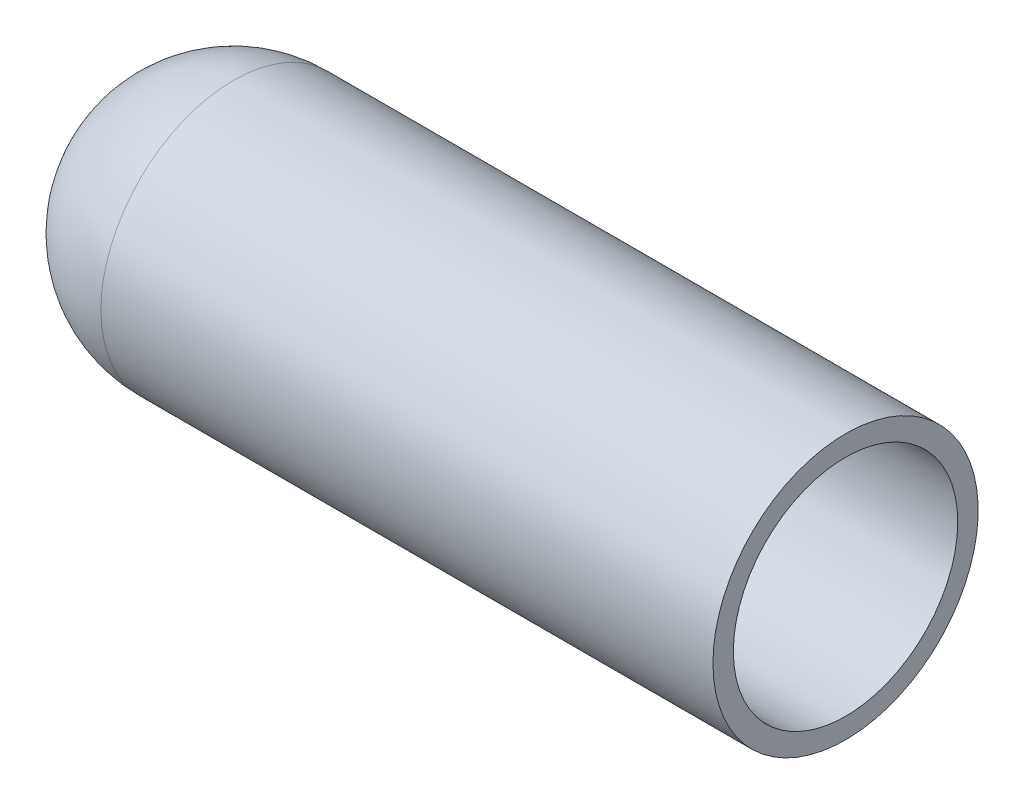
ISO-10303-21;
HEADER;
FILE_DESCRIPTION(('STEP AP214'),'2;1');
FILE_NAME('part.step','',(''),(''),'','','');
FILE_SCHEMA(('AUTOMOTIVE_DESIGN { 1 0 10303 214 1 1 1 1 }'));
ENDSEC;
DATA;
#1=APPLICATION_CONTEXT('core data for automotive mechanical design processes');
#2=APPLICATION_PROTOCOL_DEFINITION('international standard','automotive_design',2000,#1);
#3=PRODUCT_CONTEXT('',#1,'mechanical');
#4=PRODUCT('Part','Part','',(#3));
#5=PRODUCT_RELATED_PRODUCT_CATEGORY('part','',(#4));
#6=PRODUCT_DEFINITION_FORMATION('','',#4);
#7=PRODUCT_DEFINITION_CONTEXT('part definition',#1,'design');
#8=PRODUCT_DEFINITION('design','',#6,#7);
#9=PRODUCT_DEFINITION_SHAPE('','',#8);
#10=(LENGTH_UNIT() NAMED_UNIT(*) SI_UNIT(.MILLI.,.METRE.));
#11=(NAMED_UNIT(*) PLANE_ANGLE_UNIT() SI_UNIT($,.RADIAN.));
#12=(NAMED_UNIT(*) SI_UNIT($,.STERADIAN.) SOLID_ANGLE_UNIT());
#13=UNCERTAINTY_MEASURE_WITH_UNIT(LENGTH_MEASURE(1.E-05),#10,'distance_accuracy_value','');
#14=(GEOMETRIC_REPRESENTATION_CONTEXT(3) GLOBAL_UNCERTAINTY_ASSIGNED_CONTEXT((#13)) GLOBAL_UNIT_ASSIGNED_CONTEXT((#10,
#11,#12)) REPRESENTATION_CONTEXT('',''));
#15=CARTESIAN_POINT('',(0.,0.,0.));
#16=DIRECTION('',(0.,0.,1.));
#17=DIRECTION('',(1.,0.,0.));
#18=AXIS2_PLACEMENT_3D('',#15,#16,#17);
#19=CARTESIAN_POINT('',(0.,0.,0.));
#20=DIRECTION('',(-1.,0.,0.));
#21=DIRECTION('',(0.,1.,0.));
#22=AXIS2_PLACEMENT_3D('',#19,#20,#21);
#23=SPHERICAL_SURFACE('',#22,3.302);
#24=CARTESIAN_POINT('',(0.,0.,0.));
#25=DIRECTION('',(-1.,0.,0.));
#26=DIRECTION('',(0.,0.,1.));
#27=AXIS2_PLACEMENT_3D('',#24,#25,#26);
#28=CIRCLE('',#27,3.302);
#29=CARTESIAN_POINT('',(0.,0.,3.302));
#30=VERTEX_POINT('',#29);
#31=EDGE_CURVE('E36',#30,#30,#28,.T.);
#32=ORIENTED_EDGE('',*,*,#31,.T.);
#33=EDGE_LOOP('',(#32));
#34=FACE_BOUND('',#33,.T.);
#35=ADVANCED_FACE('F30',(#34),#23,.T.);
#36=CARTESIAN_POINT('',(15.24,3.302,0.));
#37=DIRECTION('',(-1.,0.,0.));
#38=DIRECTION('',(0.,0.,1.));
#39=AXIS2_PLACEMENT_3D('',#36,#37,#38);
#40=PLANE('',#39);
#41=CARTESIAN_POINT('',(15.24,0.,0.));
#42=DIRECTION('',(-1.,0.,0.));
#43=DIRECTION('',(0.,0.,1.));
#44=AXIS2_PLACEMENT_3D('',#41,#42,#43);
#45=CIRCLE('',#44,2.794);
#46=CARTESIAN_POINT('',(15.24,0.,2.794));
#47=VERTEX_POINT('',#46);
#48=EDGE_CURVE('E40',#47,#47,#45,.T.);
#49=ORIENTED_EDGE('',*,*,#48,.T.);
#50=EDGE_LOOP('',(#49));
#51=FACE_BOUND('',#50,.T.);
#52=CARTESIAN_POINT('',(15.24,0.,0.));
#53=DIRECTION('',(-1.,0.,0.));
#54=DIRECTION('',(0.,0.,1.));
#55=AXIS2_PLACEMENT_3D('',#52,#53,#54);
#56=CIRCLE('',#55,3.302);
#57=CARTESIAN_POINT('',(15.24,0.,3.302));
#58=VERTEX_POINT('',#57);
#59=EDGE_CURVE('E10',#58,#58,#56,.T.);
#60=ORIENTED_EDGE('',*,*,#59,.F.);
#61=EDGE_LOOP('',(#60));
#62=FACE_BOUND('',#61,.T.);
#63=ADVANCED_FACE('F62',(#51,#62),#40,.F.);
#64=CARTESIAN_POINT('',(-3.302,0.,0.));
#65=DIRECTION('',(-1.,0.,0.));
#66=DIRECTION('',(0.,0.,1.));
#67=AXIS2_PLACEMENT_3D('',#64,#65,#66);
#68=CYLINDRICAL_SURFACE('',#67,3.302);
#69=ORIENTED_EDGE('',*,*,#31,.F.);
#70=EDGE_LOOP('',(#69));
#71=FACE_BOUND('',#70,.T.);
#72=ORIENTED_EDGE('',*,*,#59,.T.);
#73=EDGE_LOOP('',(#72));
#74=FACE_BOUND('',#73,.T.);
#75=ADVANCED_FACE('F55',(#71,#74),#68,.T.);
#76=CARTESIAN_POINT('',(0.,0.,0.));
#77=DIRECTION('',(-1.,0.,0.));
#78=DIRECTION('',(0.,1.,0.));
#79=AXIS2_PLACEMENT_3D('',#76,#77,#78);
#80=SPHERICAL_SURFACE('',#79,2.794);
#81=CARTESIAN_POINT('',(0.,0.,0.));
#82=DIRECTION('',(-1.,0.,0.));
#83=DIRECTION('',(0.,0.,1.));
#84=AXIS2_PLACEMENT_3D('',#81,#82,#83);
#85=CIRCLE('',#84,2.794);
#86=CARTESIAN_POINT('',(0.,0.,2.794));
#87=VERTEX_POINT('',#86);
#88=EDGE_CURVE('E44',#87,#87,#85,.T.);
#89=ORIENTED_EDGE('',*,*,#88,.F.);
#90=EDGE_LOOP('',(#89));
#91=FACE_BOUND('',#90,.T.);
#92=ADVANCED_FACE('F53',(#91),#80,.F.);
#93=CARTESIAN_POINT('',(-3.302,0.,0.));
#94=DIRECTION('',(-1.,0.,0.));
#95=DIRECTION('',(0.,0.,1.));
#96=AXIS2_PLACEMENT_3D('',#93,#94,#95);
#97=CYLINDRICAL_SURFACE('',#96,2.794);
#98=ORIENTED_EDGE('',*,*,#88,.T.);
#99=EDGE_LOOP('',(#98));
#100=FACE_BOUND('',#99,.T.);
#101=ORIENTED_EDGE('',*,*,#48,.F.);
#102=EDGE_LOOP('',(#101));
#103=FACE_BOUND('',#102,.T.);
#104=ADVANCED_FACE('F50',(#100,#103),#97,.F.);
#105=CLOSED_SHELL('',(#35,#63,#75,#92,#104));
#106=MANIFOLD_SOLID_BREP('B2',#105);
#107=ADVANCED_BREP_SHAPE_REPRESENTATION('',(#18,#106),#14);
#108=SHAPE_DEFINITION_REPRESENTATION(#9,#107);
ENDSEC;
END-ISO-10303-21;
